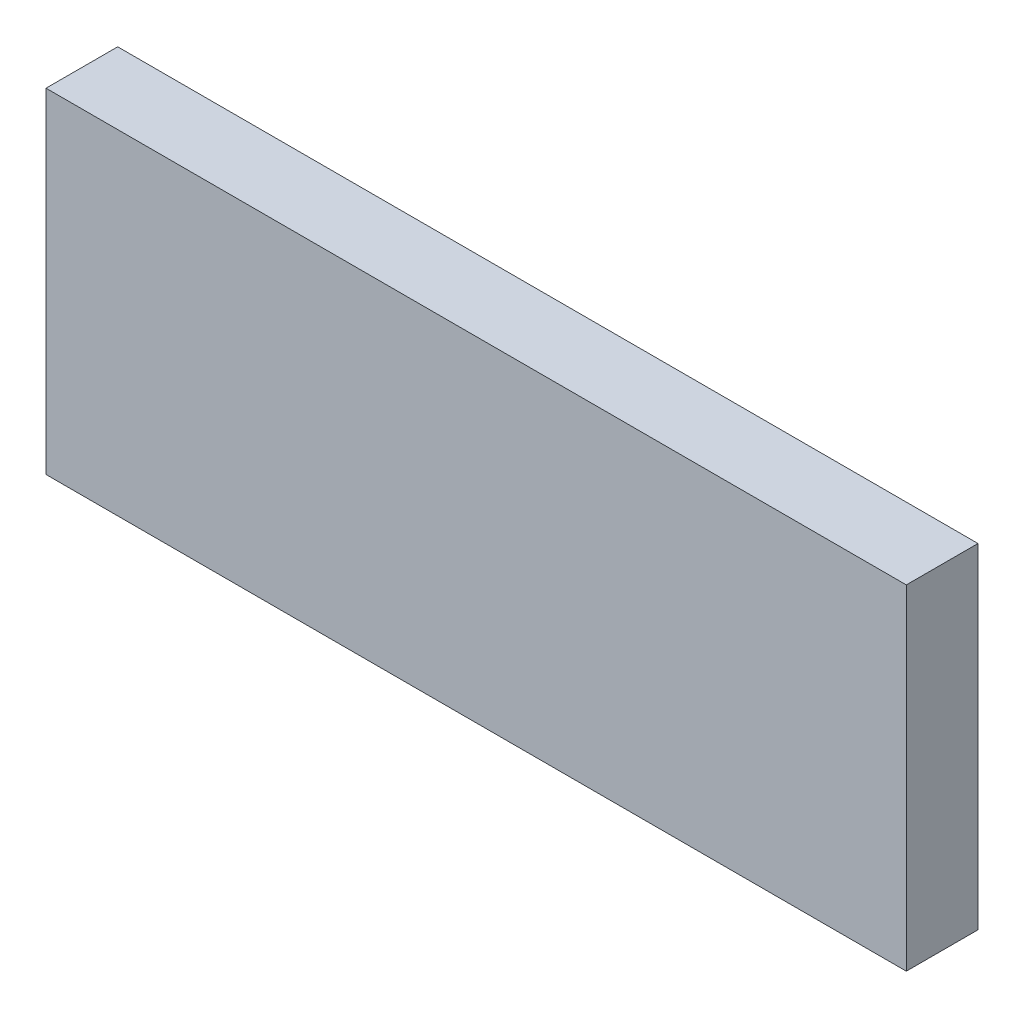
ISO-10303-21;
HEADER;
FILE_DESCRIPTION(('STEP AP214'),'2;1');
FILE_NAME('part.step','',(''),(''),'','','');
FILE_SCHEMA(('AUTOMOTIVE_DESIGN { 1 0 10303 214 1 1 1 1 }'));
ENDSEC;
DATA;
#1=APPLICATION_CONTEXT('core data for automotive mechanical design processes');
#2=APPLICATION_PROTOCOL_DEFINITION('international standard','automotive_design',2000,#1);
#3=PRODUCT_CONTEXT('',#1,'mechanical');
#4=PRODUCT('Part','Part','',(#3));
#5=PRODUCT_RELATED_PRODUCT_CATEGORY('part','',(#4));
#6=PRODUCT_DEFINITION_FORMATION('','',#4);
#7=PRODUCT_DEFINITION_CONTEXT('part definition',#1,'design');
#8=PRODUCT_DEFINITION('design','',#6,#7);
#9=PRODUCT_DEFINITION_SHAPE('','',#8);
#10=(LENGTH_UNIT() NAMED_UNIT(*) SI_UNIT(.MILLI.,.METRE.));
#11=(NAMED_UNIT(*) PLANE_ANGLE_UNIT() SI_UNIT($,.RADIAN.));
#12=(NAMED_UNIT(*) SI_UNIT($,.STERADIAN.) SOLID_ANGLE_UNIT());
#13=UNCERTAINTY_MEASURE_WITH_UNIT(LENGTH_MEASURE(1.E-05),#10,'distance_accuracy_value','');
#14=(GEOMETRIC_REPRESENTATION_CONTEXT(3) GLOBAL_UNCERTAINTY_ASSIGNED_CONTEXT((#13)) GLOBAL_UNIT_ASSIGNED_CONTEXT((#10,
#11,#12)) REPRESENTATION_CONTEXT('',''));
#15=CARTESIAN_POINT('',(0.,0.,0.));
#16=DIRECTION('',(0.,0.,1.));
#17=DIRECTION('',(1.,0.,0.));
#18=AXIS2_PLACEMENT_3D('',#15,#16,#17);
#19=CARTESIAN_POINT('',(0.,0.,0.));
#20=DIRECTION('',(0.,0.,1.));
#21=DIRECTION('',(1.,0.,0.));
#22=AXIS2_PLACEMENT_3D('',#19,#20,#21);
#23=PLANE('',#22);
#24=DIRECTION('',(1.,0.,0.));
#25=VECTOR('',#24,1.);
#26=CARTESIAN_POINT('',(1.95,-1.85,0.));
#27=LINE('',#26,#25);
#28=CARTESIAN_POINT('',(3.75,-1.85,0.));
#29=VERTEX_POINT('',#28);
#30=CARTESIAN_POINT('',(1.95,-1.85,0.));
#31=VERTEX_POINT('',#30);
#32=EDGE_CURVE('E81',#29,#31,#27,.F.);
#33=ORIENTED_EDGE('',*,*,#32,.T.);
#34=DIRECTION('',(0.,1.,0.));
#35=VECTOR('',#34,1.);
#36=CARTESIAN_POINT('',(1.95,-1.15,0.));
#37=LINE('',#36,#35);
#38=CARTESIAN_POINT('',(1.95,-1.15,0.));
#39=VERTEX_POINT('',#38);
#40=EDGE_CURVE('E68',#31,#39,#37,.T.);
#41=ORIENTED_EDGE('',*,*,#40,.T.);
#42=DIRECTION('',(1.,0.,0.));
#43=VECTOR('',#42,1.);
#44=CARTESIAN_POINT('',(3.75,-1.15,0.));
#45=LINE('',#44,#43);
#46=CARTESIAN_POINT('',(3.75,-1.15,0.));
#47=VERTEX_POINT('',#46);
#48=EDGE_CURVE('E55',#39,#47,#45,.T.);
#49=ORIENTED_EDGE('',*,*,#48,.T.);
#50=DIRECTION('',(0.,-1.,0.));
#51=VECTOR('',#50,1.);
#52=CARTESIAN_POINT('',(3.75,-1.85,0.));
#53=LINE('',#52,#51);
#54=EDGE_CURVE('E20',#47,#29,#53,.T.);
#55=ORIENTED_EDGE('',*,*,#54,.T.);
#56=EDGE_LOOP('',(#33,#41,#49,#55));
#57=FACE_BOUND('',#56,.T.);
#58=ADVANCED_FACE('F17',(#57),#23,.F.);
#59=CARTESIAN_POINT('',(3.75,-1.85,0.15));
#60=DIRECTION('',(-1.,0.,0.));
#61=DIRECTION('',(0.,-1.,0.));
#62=AXIS2_PLACEMENT_3D('',#59,#60,#61);
#63=PLANE('',#62);
#64=DIRECTION('',(0.,0.,1.));
#65=VECTOR('',#64,1.);
#66=CARTESIAN_POINT('',(3.75,-1.15,0.15));
#67=LINE('',#66,#65);
#68=CARTESIAN_POINT('',(3.75,-1.15,0.15));
#69=VERTEX_POINT('',#68);
#70=EDGE_CURVE('E61',#47,#69,#67,.T.);
#71=ORIENTED_EDGE('',*,*,#70,.T.);
#72=DIRECTION('',(0.,1.,0.));
#73=VECTOR('',#72,1.);
#74=CARTESIAN_POINT('',(3.75,0.,0.15));
#75=LINE('',#74,#73);
#76=CARTESIAN_POINT('',(3.75,-1.85,0.15));
#77=VERTEX_POINT('',#76);
#78=EDGE_CURVE('E83',#77,#69,#75,.T.);
#79=ORIENTED_EDGE('',*,*,#78,.F.);
#80=DIRECTION('',(0.,0.,1.));
#81=VECTOR('',#80,1.);
#82=CARTESIAN_POINT('',(3.75,-1.85,0.15));
#83=LINE('',#82,#81);
#84=EDGE_CURVE('E64',#77,#29,#83,.F.);
#85=ORIENTED_EDGE('',*,*,#84,.T.);
#86=ORIENTED_EDGE('',*,*,#54,.F.);
#87=EDGE_LOOP('',(#71,#79,#85,#86));
#88=FACE_BOUND('',#87,.T.);
#89=ADVANCED_FACE('F60',(#88),#63,.F.);
#90=CARTESIAN_POINT('',(3.75,-1.15,0.15));
#91=DIRECTION('',(0.,-1.,0.));
#92=DIRECTION('',(1.,0.,0.));
#93=AXIS2_PLACEMENT_3D('',#90,#91,#92);
#94=PLANE('',#93);
#95=DIRECTION('',(0.,0.,-1.));
#96=VECTOR('',#95,1.);
#97=CARTESIAN_POINT('',(1.95,-1.15,0.15));
#98=LINE('',#97,#96);
#99=CARTESIAN_POINT('',(1.95,-1.15,0.15));
#100=VERTEX_POINT('',#99);
#101=EDGE_CURVE('E70',#39,#100,#98,.F.);
#102=ORIENTED_EDGE('',*,*,#101,.T.);
#103=DIRECTION('',(1.,0.,0.));
#104=VECTOR('',#103,1.);
#105=CARTESIAN_POINT('',(0.,-1.15,0.15));
#106=LINE('',#105,#104);
#107=EDGE_CURVE('E74',#69,#100,#106,.F.);
#108=ORIENTED_EDGE('',*,*,#107,.F.);
#109=ORIENTED_EDGE('',*,*,#70,.F.);
#110=ORIENTED_EDGE('',*,*,#48,.F.);
#111=EDGE_LOOP('',(#102,#108,#109,#110));
#112=FACE_BOUND('',#111,.T.);
#113=ADVANCED_FACE('F72',(#112),#94,.F.);
#114=CARTESIAN_POINT('',(1.95,-1.15,0.15));
#115=DIRECTION('',(1.,0.,0.));
#116=DIRECTION('',(0.,0.,-1.));
#117=AXIS2_PLACEMENT_3D('',#114,#115,#116);
#118=PLANE('',#117);
#119=DIRECTION('',(0.,0.,1.));
#120=VECTOR('',#119,1.);
#121=CARTESIAN_POINT('',(1.95,-1.85,0.15));
#122=LINE('',#121,#120);
#123=CARTESIAN_POINT('',(1.95,-1.85,0.15));
#124=VERTEX_POINT('',#123);
#125=EDGE_CURVE('E35',#31,#124,#122,.T.);
#126=ORIENTED_EDGE('',*,*,#125,.T.);
#127=DIRECTION('',(0.,1.,0.));
#128=VECTOR('',#127,1.);
#129=CARTESIAN_POINT('',(1.95,0.,0.15));
#130=LINE('',#129,#128);
#131=EDGE_CURVE('E26',#100,#124,#130,.F.);
#132=ORIENTED_EDGE('',*,*,#131,.F.);
#133=ORIENTED_EDGE('',*,*,#101,.F.);
#134=ORIENTED_EDGE('',*,*,#40,.F.);
#135=EDGE_LOOP('',(#126,#132,#133,#134));
#136=FACE_BOUND('',#135,.T.);
#137=ADVANCED_FACE('F89',(#136),#118,.F.);
#138=CARTESIAN_POINT('',(1.95,-1.85,0.15));
#139=DIRECTION('',(0.,1.,0.));
#140=DIRECTION('',(0.,0.,1.));
#141=AXIS2_PLACEMENT_3D('',#138,#139,#140);
#142=PLANE('',#141);
#143=ORIENTED_EDGE('',*,*,#84,.F.);
#144=DIRECTION('',(1.,0.,0.));
#145=VECTOR('',#144,1.);
#146=CARTESIAN_POINT('',(0.,-1.85,0.15));
#147=LINE('',#146,#145);
#148=EDGE_CURVE('E11',#124,#77,#147,.T.);
#149=ORIENTED_EDGE('',*,*,#148,.F.);
#150=ORIENTED_EDGE('',*,*,#125,.F.);
#151=ORIENTED_EDGE('',*,*,#32,.F.);
#152=EDGE_LOOP('',(#143,#149,#150,#151));
#153=FACE_BOUND('',#152,.T.);
#154=ADVANCED_FACE('F91',(#153),#142,.F.);
#155=CARTESIAN_POINT('',(0.,0.,0.15));
#156=DIRECTION('',(0.,0.,1.));
#157=DIRECTION('',(1.,0.,0.));
#158=AXIS2_PLACEMENT_3D('',#155,#156,#157);
#159=PLANE('',#158);
#160=ORIENTED_EDGE('',*,*,#131,.T.);
#161=ORIENTED_EDGE('',*,*,#148,.T.);
#162=ORIENTED_EDGE('',*,*,#78,.T.);
#163=ORIENTED_EDGE('',*,*,#107,.T.);
#164=EDGE_LOOP('',(#160,#161,#162,#163));
#165=FACE_BOUND('',#164,.T.);
#166=ADVANCED_FACE('F88',(#165),#159,.T.);
#167=CLOSED_SHELL('',(#58,#89,#113,#137,#154,#166));
#168=MANIFOLD_SOLID_BREP('B1',#167);
#169=ADVANCED_BREP_SHAPE_REPRESENTATION('',(#18,#168),#14);
#170=SHAPE_DEFINITION_REPRESENTATION(#9,#169);
ENDSEC;
END-ISO-10303-21;
